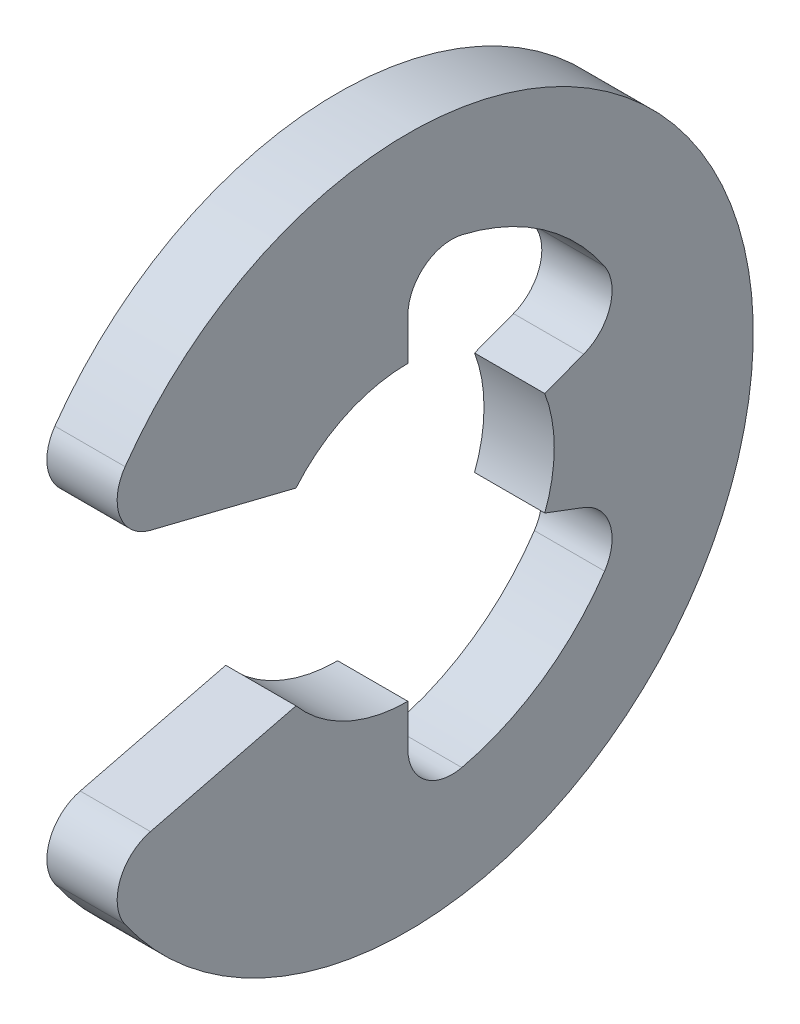
ISO-10303-21;
HEADER;
FILE_DESCRIPTION(('STEP AP214'),'2;1');
FILE_NAME('part.step','',(''),(''),'','','');
FILE_SCHEMA(('AUTOMOTIVE_DESIGN { 1 0 10303 214 1 1 1 1 }'));
ENDSEC;
DATA;
#1=APPLICATION_CONTEXT('core data for automotive mechanical design processes');
#2=APPLICATION_PROTOCOL_DEFINITION('international standard','automotive_design',2000,#1);
#3=PRODUCT_CONTEXT('',#1,'mechanical');
#4=PRODUCT('Part','Part','',(#3));
#5=PRODUCT_RELATED_PRODUCT_CATEGORY('part','',(#4));
#6=PRODUCT_DEFINITION_FORMATION('','',#4);
#7=PRODUCT_DEFINITION_CONTEXT('part definition',#1,'design');
#8=PRODUCT_DEFINITION('design','',#6,#7);
#9=PRODUCT_DEFINITION_SHAPE('','',#8);
#10=(LENGTH_UNIT() NAMED_UNIT(*) SI_UNIT(.MILLI.,.METRE.));
#11=(NAMED_UNIT(*) PLANE_ANGLE_UNIT() SI_UNIT($,.RADIAN.));
#12=(NAMED_UNIT(*) SI_UNIT($,.STERADIAN.) SOLID_ANGLE_UNIT());
#13=UNCERTAINTY_MEASURE_WITH_UNIT(LENGTH_MEASURE(1.E-05),#10,'distance_accuracy_value','');
#14=(GEOMETRIC_REPRESENTATION_CONTEXT(3) GLOBAL_UNCERTAINTY_ASSIGNED_CONTEXT((#13)) GLOBAL_UNIT_ASSIGNED_CONTEXT((#10,
#11,#12)) REPRESENTATION_CONTEXT('',''));
#15=CARTESIAN_POINT('',(0.,0.,0.));
#16=DIRECTION('',(0.,0.,1.));
#17=DIRECTION('',(1.,0.,0.));
#18=AXIS2_PLACEMENT_3D('',#15,#16,#17);
#19=CARTESIAN_POINT('',(0.3,0.,0.));
#20=DIRECTION('',(-1.,0.,0.));
#21=DIRECTION('',(0.,0.,1.));
#22=AXIS2_PLACEMENT_3D('',#19,#20,#21);
#23=CYLINDRICAL_SURFACE('',#22,2.95);
#24=CARTESIAN_POINT('',(0.3,0.,0.));
#25=DIRECTION('',(1.,0.,0.));
#26=DIRECTION('',(0.,0.,-1.));
#27=AXIS2_PLACEMENT_3D('',#24,#25,#26);
#28=CIRCLE('',#27,2.95);
#29=CARTESIAN_POINT('',(0.3,-1.69333134739096,2.4156011566364));
#30=VERTEX_POINT('',#29);
#31=CARTESIAN_POINT('',(0.3,1.69333134739096,2.4156011566364));
#32=VERTEX_POINT('',#31);
#33=EDGE_CURVE('E179',#30,#32,#28,.T.);
#34=ORIENTED_EDGE('',*,*,#33,.F.);
#35=DIRECTION('',(-1.,0.,0.));
#36=VECTOR('',#35,1.);
#37=CARTESIAN_POINT('',(0.3,-1.69333134739096,2.4156011566364));
#38=LINE('',#37,#36);
#39=CARTESIAN_POINT('',(-0.3,-1.69333134739096,2.4156011566364));
#40=VERTEX_POINT('',#39);
#41=EDGE_CURVE('E219',#30,#40,#38,.T.);
#42=ORIENTED_EDGE('',*,*,#41,.T.);
#43=CARTESIAN_POINT('',(-0.3,0.,0.));
#44=DIRECTION('',(1.,0.,0.));
#45=DIRECTION('',(0.,0.,-1.));
#46=AXIS2_PLACEMENT_3D('',#43,#44,#45);
#47=CIRCLE('',#46,2.95);
#48=CARTESIAN_POINT('',(-0.3,1.69333134739096,2.4156011566364));
#49=VERTEX_POINT('',#48);
#50=EDGE_CURVE('E163',#40,#49,#47,.T.);
#51=ORIENTED_EDGE('',*,*,#50,.T.);
#52=DIRECTION('',(-1.,0.,0.));
#53=VECTOR('',#52,1.);
#54=CARTESIAN_POINT('',(0.3,1.69333134739096,2.4156011566364));
#55=LINE('',#54,#53);
#56=EDGE_CURVE('E217',#49,#32,#55,.F.);
#57=ORIENTED_EDGE('',*,*,#56,.T.);
#58=EDGE_LOOP('',(#34,#42,#51,#57));
#59=FACE_BOUND('',#58,.T.);
#60=ADVANCED_FACE('F16',(#59),#23,.T.);
#61=CARTESIAN_POINT('',(0.3,1.2335036372562,2.67973296745697));
#62=DIRECTION('',(0.,0.970536829925373,-0.240952820606874));
#63=DIRECTION('',(0.,0.240952820606874,0.970536829925373));
#64=AXIS2_PLACEMENT_3D('',#61,#62,#63);
#65=PLANE('',#64);
#66=DIRECTION('',(0.,-0.240952820606874,-0.970536829925373));
#67=VECTOR('',#66,1.);
#68=CARTESIAN_POINT('',(-0.3,1.2335036372562,2.67973296745697));
#69=LINE('',#68,#67);
#70=CARTESIAN_POINT('',(-0.3,1.11412605133111,2.19889052072376));
#71=VERTEX_POINT('',#70);
#72=CARTESIAN_POINT('',(-0.3,0.80551824928254,0.955845358869725));
#73=VERTEX_POINT('',#72);
#74=EDGE_CURVE('E158',#71,#73,#69,.T.);
#75=ORIENTED_EDGE('',*,*,#74,.T.);
#76=DIRECTION('',(1.,0.,0.));
#77=VECTOR('',#76,1.);
#78=CARTESIAN_POINT('',(-0.3,0.80551824928254,0.955845358869724));
#79=LINE('',#78,#77);
#80=CARTESIAN_POINT('',(0.3,0.80551824928254,0.955845358869724));
#81=VERTEX_POINT('',#80);
#82=EDGE_CURVE('E31',#73,#81,#79,.T.);
#83=ORIENTED_EDGE('',*,*,#82,.T.);
#84=DIRECTION('',(0.,-0.240952820606874,-0.970536829925373));
#85=VECTOR('',#84,1.);
#86=CARTESIAN_POINT('',(0.3,1.2335036372562,2.67973296745697));
#87=LINE('',#86,#85);
#88=CARTESIAN_POINT('',(0.3,1.11412605133111,2.19889052072376));
#89=VERTEX_POINT('',#88);
#90=EDGE_CURVE('E182',#89,#81,#87,.T.);
#91=ORIENTED_EDGE('',*,*,#90,.F.);
#92=DIRECTION('',(-1.,0.,0.));
#93=VECTOR('',#92,1.);
#94=CARTESIAN_POINT('',(0.3,1.11412605133111,2.19889052072376));
#95=LINE('',#94,#93);
#96=EDGE_CURVE('E234',#89,#71,#95,.T.);
#97=ORIENTED_EDGE('',*,*,#96,.T.);
#98=EDGE_LOOP('',(#75,#83,#91,#97));
#99=FACE_BOUND('',#98,.T.);
#100=ADVANCED_FACE('F311',(#99),#65,.F.);
#101=CARTESIAN_POINT('',(0.3,0.97,0.));
#102=DIRECTION('',(0.,0.,1.));
#103=DIRECTION('',(0.,-1.,0.));
#104=AXIS2_PLACEMENT_3D('',#101,#102,#103);
#105=PLANE('',#104);
#106=DIRECTION('',(0.,1.,0.));
#107=VECTOR('',#106,1.);
#108=CARTESIAN_POINT('',(0.3,0.97,0.));
#109=LINE('',#108,#107);
#110=CARTESIAN_POINT('',(0.3,1.25,0.));
#111=VERTEX_POINT('',#110);
#112=CARTESIAN_POINT('',(0.3,1.60499947322517,0.));
#113=VERTEX_POINT('',#112);
#114=EDGE_CURVE('E151',#111,#113,#109,.T.);
#115=ORIENTED_EDGE('',*,*,#114,.F.);
#116=DIRECTION('',(1.,0.,0.));
#117=VECTOR('',#116,1.);
#118=CARTESIAN_POINT('',(-0.3,1.25,0.));
#119=LINE('',#118,#117);
#120=CARTESIAN_POINT('',(-0.3,1.25,0.));
#121=VERTEX_POINT('',#120);
#122=EDGE_CURVE('E139',#111,#121,#119,.F.);
#123=ORIENTED_EDGE('',*,*,#122,.T.);
#124=DIRECTION('',(0.,1.,0.));
#125=VECTOR('',#124,1.);
#126=CARTESIAN_POINT('',(-0.3,0.97,0.));
#127=LINE('',#126,#125);
#128=CARTESIAN_POINT('',(-0.3,1.60499947322517,0.));
#129=VERTEX_POINT('',#128);
#130=EDGE_CURVE('E149',#121,#129,#127,.T.);
#131=ORIENTED_EDGE('',*,*,#130,.T.);
#132=DIRECTION('',(1.,0.,0.));
#133=VECTOR('',#132,1.);
#134=CARTESIAN_POINT('',(0.3,1.60499947322517,0.));
#135=LINE('',#134,#133);
#136=EDGE_CURVE('E215',#129,#113,#135,.T.);
#137=ORIENTED_EDGE('',*,*,#136,.T.);
#138=EDGE_LOOP('',(#115,#123,#131,#137));
#139=FACE_BOUND('',#138,.T.);
#140=ADVANCED_FACE('F147',(#139),#105,.F.);
#141=CARTESIAN_POINT('',(0.3,0.,0.));
#142=DIRECTION('',(-1.,0.,0.));
#143=DIRECTION('',(0.,0.,1.));
#144=AXIS2_PLACEMENT_3D('',#141,#142,#143);
#145=CYLINDRICAL_SURFACE('',#144,2.02322580645161);
#146=CARTESIAN_POINT('',(0.3,0.,0.));
#147=DIRECTION('',(-1.,0.,0.));
#148=DIRECTION('',(0.,0.,-1.));
#149=AXIS2_PLACEMENT_3D('',#146,#147,#148);
#150=CIRCLE('',#149,2.02322580645161);
#151=CARTESIAN_POINT('',(0.3,1.97016473159179,-0.460319013602111));
#152=VERTEX_POINT('',#151);
#153=CARTESIAN_POINT('',(0.3,1.12714743026078,-1.6801730072669));
#154=VERTEX_POINT('',#153);
#155=EDGE_CURVE('E186',#152,#154,#150,.T.);
#156=ORIENTED_EDGE('',*,*,#155,.F.);
#157=DIRECTION('',(-1.,0.,0.));
#158=VECTOR('',#157,1.);
#159=CARTESIAN_POINT('',(0.3,1.97016473159179,-0.460319013602111));
#160=LINE('',#159,#158);
#161=CARTESIAN_POINT('',(-0.3,1.97016473159179,-0.460319013602111));
#162=VERTEX_POINT('',#161);
#163=EDGE_CURVE('E212',#152,#162,#160,.T.);
#164=ORIENTED_EDGE('',*,*,#163,.T.);
#165=CARTESIAN_POINT('',(-0.3,0.,0.));
#166=DIRECTION('',(-1.,0.,0.));
#167=DIRECTION('',(0.,0.,-1.));
#168=AXIS2_PLACEMENT_3D('',#165,#166,#167);
#169=CIRCLE('',#168,2.02322580645161);
#170=CARTESIAN_POINT('',(-0.3,1.12714743026078,-1.6801730072669));
#171=VERTEX_POINT('',#170);
#172=EDGE_CURVE('E157',#162,#171,#169,.T.);
#173=ORIENTED_EDGE('',*,*,#172,.T.);
#174=DIRECTION('',(-1.,0.,0.));
#175=VECTOR('',#174,1.);
#176=CARTESIAN_POINT('',(0.3,1.12714743026078,-1.6801730072669));
#177=LINE('',#176,#175);
#178=EDGE_CURVE('E210',#171,#154,#177,.F.);
#179=ORIENTED_EDGE('',*,*,#178,.T.);
#180=EDGE_LOOP('',(#156,#164,#173,#179));
#181=FACE_BOUND('',#180,.T.);
#182=ADVANCED_FACE('F318',(#181),#145,.F.);
#183=CARTESIAN_POINT('',(0.3,0.342946788875474,-0.907351916292681));
#184=DIRECTION('',(0.,-0.935414346693485,-0.353553390593276));
#185=DIRECTION('',(0.,0.353553390593276,-0.935414346693485));
#186=AXIS2_PLACEMENT_3D('',#183,#184,#185);
#187=PLANE('',#186);
#188=DIRECTION('',(0.,-0.353553390593276,0.935414346693485));
#189=VECTOR('',#188,1.);
#190=CARTESIAN_POINT('',(-0.3,0.342946788875474,-0.907351916292681));
#191=LINE('',#190,#189);
#192=CARTESIAN_POINT('',(-0.3,0.567453005659178,-1.50133953369031));
#193=VERTEX_POINT('',#192);
#194=CARTESIAN_POINT('',(-0.3,0.441941738241592,-1.16926793336686));
#195=VERTEX_POINT('',#194);
#196=EDGE_CURVE('E161',#193,#195,#191,.T.);
#197=ORIENTED_EDGE('',*,*,#196,.T.);
#198=DIRECTION('',(1.,0.,0.));
#199=VECTOR('',#198,1.);
#200=CARTESIAN_POINT('',(-0.3,0.441941738241592,-1.16926793336686));
#201=LINE('',#200,#199);
#202=CARTESIAN_POINT('',(0.3,0.441941738241591,-1.16926793336686));
#203=VERTEX_POINT('',#202);
#204=EDGE_CURVE('E38',#195,#203,#201,.T.);
#205=ORIENTED_EDGE('',*,*,#204,.T.);
#206=DIRECTION('',(0.,-0.353553390593276,0.935414346693485));
#207=VECTOR('',#206,1.);
#208=CARTESIAN_POINT('',(0.3,0.342946788875474,-0.907351916292681));
#209=LINE('',#208,#207);
#210=CARTESIAN_POINT('',(0.3,0.567453005659178,-1.50133953369031));
#211=VERTEX_POINT('',#210);
#212=EDGE_CURVE('E189',#211,#203,#209,.T.);
#213=ORIENTED_EDGE('',*,*,#212,.F.);
#214=DIRECTION('',(1.,0.,0.));
#215=VECTOR('',#214,1.);
#216=CARTESIAN_POINT('',(-0.3,0.567453005659177,-1.50133953369031));
#217=LINE('',#216,#215);
#218=EDGE_CURVE('E240',#211,#193,#217,.F.);
#219=ORIENTED_EDGE('',*,*,#218,.T.);
#220=EDGE_LOOP('',(#197,#205,#213,#219));
#221=FACE_BOUND('',#220,.T.);
#222=ADVANCED_FACE('F323',(#221),#187,.F.);
#223=CARTESIAN_POINT('',(0.3,-0.342946788875474,-0.907351916292681));
#224=DIRECTION('',(0.,0.935414346693485,-0.353553390593275));
#225=DIRECTION('',(0.,0.353553390593275,0.935414346693485));
#226=AXIS2_PLACEMENT_3D('',#223,#224,#225);
#227=PLANE('',#226);
#228=DIRECTION('',(0.,-0.353553390593275,-0.935414346693485));
#229=VECTOR('',#228,1.);
#230=CARTESIAN_POINT('',(0.3,-0.342946788875474,-0.907351916292681));
#231=LINE('',#230,#229);
#232=CARTESIAN_POINT('',(0.3,-0.441941738241591,-1.16926793336686));
#233=VERTEX_POINT('',#232);
#234=CARTESIAN_POINT('',(0.3,-0.567453005659177,-1.50133953369031));
#235=VERTEX_POINT('',#234);
#236=EDGE_CURVE('E192',#233,#235,#231,.T.);
#237=ORIENTED_EDGE('',*,*,#236,.F.);
#238=DIRECTION('',(1.,0.,0.));
#239=VECTOR('',#238,1.);
#240=CARTESIAN_POINT('',(-0.3,-0.441941738241591,-1.16926793336686));
#241=LINE('',#240,#239);
#242=CARTESIAN_POINT('',(-0.3,-0.441941738241591,-1.16926793336686));
#243=VERTEX_POINT('',#242);
#244=EDGE_CURVE('E290',#233,#243,#241,.F.);
#245=ORIENTED_EDGE('',*,*,#244,.T.);
#246=DIRECTION('',(0.,-0.353553390593275,-0.935414346693485));
#247=VECTOR('',#246,1.);
#248=CARTESIAN_POINT('',(-0.3,-0.342946788875474,-0.907351916292681));
#249=LINE('',#248,#247);
#250=CARTESIAN_POINT('',(-0.3,-0.567453005659177,-1.50133953369031));
#251=VERTEX_POINT('',#250);
#252=EDGE_CURVE('E169',#243,#251,#249,.T.);
#253=ORIENTED_EDGE('',*,*,#252,.T.);
#254=DIRECTION('',(1.,0.,0.));
#255=VECTOR('',#254,1.);
#256=CARTESIAN_POINT('',(0.3,-0.567453005659177,-1.50133953369031));
#257=LINE('',#256,#255);
#258=EDGE_CURVE('E237',#251,#235,#257,.T.);
#259=ORIENTED_EDGE('',*,*,#258,.T.);
#260=EDGE_LOOP('',(#237,#245,#253,#259));
#261=FACE_BOUND('',#260,.T.);
#262=ADVANCED_FACE('F289',(#261),#227,.F.);
#263=CARTESIAN_POINT('',(0.3,0.,0.));
#264=DIRECTION('',(-1.,0.,0.));
#265=DIRECTION('',(0.,0.,1.));
#266=AXIS2_PLACEMENT_3D('',#263,#264,#265);
#267=CYLINDRICAL_SURFACE('',#266,2.02322580645161);
#268=CARTESIAN_POINT('',(-0.3,0.,0.));
#269=DIRECTION('',(-1.,0.,0.));
#270=DIRECTION('',(0.,0.,-1.));
#271=AXIS2_PLACEMENT_3D('',#268,#269,#270);
#272=CIRCLE('',#271,2.02322580645161);
#273=CARTESIAN_POINT('',(-0.3,-1.12714743026078,-1.6801730072669));
#274=VERTEX_POINT('',#273);
#275=CARTESIAN_POINT('',(-0.3,-1.97016473159179,-0.460319013602112));
#276=VERTEX_POINT('',#275);
#277=EDGE_CURVE('E171',#274,#276,#272,.T.);
#278=ORIENTED_EDGE('',*,*,#277,.T.);
#279=DIRECTION('',(-1.,0.,0.));
#280=VECTOR('',#279,1.);
#281=CARTESIAN_POINT('',(0.3,-1.97016473159179,-0.460319013602112));
#282=LINE('',#281,#280);
#283=CARTESIAN_POINT('',(0.3,-1.97016473159179,-0.460319013602112));
#284=VERTEX_POINT('',#283);
#285=EDGE_CURVE('E208',#276,#284,#282,.F.);
#286=ORIENTED_EDGE('',*,*,#285,.T.);
#287=CARTESIAN_POINT('',(0.3,0.,0.));
#288=DIRECTION('',(-1.,0.,0.));
#289=DIRECTION('',(0.,0.,-1.));
#290=AXIS2_PLACEMENT_3D('',#287,#288,#289);
#291=CIRCLE('',#290,2.02322580645161);
#292=CARTESIAN_POINT('',(0.3,-1.12714743026078,-1.6801730072669));
#293=VERTEX_POINT('',#292);
#294=EDGE_CURVE('E194',#293,#284,#291,.T.);
#295=ORIENTED_EDGE('',*,*,#294,.F.);
#296=DIRECTION('',(-1.,0.,0.));
#297=VECTOR('',#296,1.);
#298=CARTESIAN_POINT('',(0.3,-1.12714743026078,-1.6801730072669));
#299=LINE('',#298,#297);
#300=EDGE_CURVE('E205',#293,#274,#299,.T.);
#301=ORIENTED_EDGE('',*,*,#300,.T.);
#302=EDGE_LOOP('',(#278,#286,#295,#301));
#303=FACE_BOUND('',#302,.T.);
#304=ADVANCED_FACE('F279',(#303),#267,.F.);
#305=CARTESIAN_POINT('',(0.3,-0.97,0.));
#306=DIRECTION('',(0.,0.,1.));
#307=DIRECTION('',(0.,-1.,0.));
#308=AXIS2_PLACEMENT_3D('',#305,#306,#307);
#309=PLANE('',#308);
#310=DIRECTION('',(0.,1.,0.));
#311=VECTOR('',#310,1.);
#312=CARTESIAN_POINT('',(-0.3,-0.97,0.));
#313=LINE('',#312,#311);
#314=CARTESIAN_POINT('',(-0.3,-1.60499947322517,0.));
#315=VERTEX_POINT('',#314);
#316=CARTESIAN_POINT('',(-0.3,-1.25,0.));
#317=VERTEX_POINT('',#316);
#318=EDGE_CURVE('E174',#315,#317,#313,.T.);
#319=ORIENTED_EDGE('',*,*,#318,.T.);
#320=DIRECTION('',(1.,0.,0.));
#321=VECTOR('',#320,1.);
#322=CARTESIAN_POINT('',(-0.3,-1.25,0.));
#323=LINE('',#322,#321);
#324=CARTESIAN_POINT('',(0.3,-1.25,0.));
#325=VERTEX_POINT('',#324);
#326=EDGE_CURVE('E271',#317,#325,#323,.T.);
#327=ORIENTED_EDGE('',*,*,#326,.T.);
#328=DIRECTION('',(0.,1.,0.));
#329=VECTOR('',#328,1.);
#330=CARTESIAN_POINT('',(0.3,-0.97,0.));
#331=LINE('',#330,#329);
#332=CARTESIAN_POINT('',(0.3,-1.60499947322517,0.));
#333=VERTEX_POINT('',#332);
#334=EDGE_CURVE('E197',#333,#325,#331,.T.);
#335=ORIENTED_EDGE('',*,*,#334,.F.);
#336=DIRECTION('',(1.,0.,0.));
#337=VECTOR('',#336,1.);
#338=CARTESIAN_POINT('',(-0.3,-1.60499947322517,0.));
#339=LINE('',#338,#337);
#340=EDGE_CURVE('E202',#333,#315,#339,.F.);
#341=ORIENTED_EDGE('',*,*,#340,.T.);
#342=EDGE_LOOP('',(#319,#327,#335,#341));
#343=FACE_BOUND('',#342,.T.);
#344=ADVANCED_FACE('F269',(#343),#309,.F.);
#345=CARTESIAN_POINT('',(0.3,-1.2335036372562,2.67973296745697));
#346=DIRECTION('',(0.,-0.970536829925373,-0.240952820606874));
#347=DIRECTION('',(0.,0.240952820606874,-0.970536829925373));
#348=AXIS2_PLACEMENT_3D('',#345,#346,#347);
#349=PLANE('',#348);
#350=DIRECTION('',(0.,-0.240952820606874,0.970536829925373));
#351=VECTOR('',#350,1.);
#352=CARTESIAN_POINT('',(0.3,-1.2335036372562,2.67973296745697));
#353=LINE('',#352,#351);
#354=CARTESIAN_POINT('',(0.3,-0.80551824928254,0.955845358869724));
#355=VERTEX_POINT('',#354);
#356=CARTESIAN_POINT('',(0.3,-1.11412605133111,2.19889052072376));
#357=VERTEX_POINT('',#356);
#358=EDGE_CURVE('E200',#355,#357,#353,.T.);
#359=ORIENTED_EDGE('',*,*,#358,.F.);
#360=DIRECTION('',(1.,0.,0.));
#361=VECTOR('',#360,1.);
#362=CARTESIAN_POINT('',(-0.3,-0.80551824928254,0.955845358869724));
#363=LINE('',#362,#361);
#364=CARTESIAN_POINT('',(-0.3,-0.80551824928254,0.955845358869724));
#365=VERTEX_POINT('',#364);
#366=EDGE_CURVE('E294',#355,#365,#363,.F.);
#367=ORIENTED_EDGE('',*,*,#366,.T.);
#368=DIRECTION('',(0.,-0.240952820606874,0.970536829925373));
#369=VECTOR('',#368,1.);
#370=CARTESIAN_POINT('',(-0.3,-1.2335036372562,2.67973296745697));
#371=LINE('',#370,#369);
#372=CARTESIAN_POINT('',(-0.3,-1.11412605133111,2.19889052072376));
#373=VERTEX_POINT('',#372);
#374=EDGE_CURVE('E177',#365,#373,#371,.T.);
#375=ORIENTED_EDGE('',*,*,#374,.T.);
#376=DIRECTION('',(-1.,0.,0.));
#377=VECTOR('',#376,1.);
#378=CARTESIAN_POINT('',(0.3,-1.11412605133111,2.19889052072376));
#379=LINE('',#378,#377);
#380=EDGE_CURVE('E227',#373,#357,#379,.F.);
#381=ORIENTED_EDGE('',*,*,#380,.T.);
#382=EDGE_LOOP('',(#359,#367,#375,#381));
#383=FACE_BOUND('',#382,.T.);
#384=ADVANCED_FACE('F334',(#383),#349,.F.);
#385=CARTESIAN_POINT('',(0.3,0.,0.));
#386=DIRECTION('',(1.,0.,0.));
#387=DIRECTION('',(0.,0.,-1.));
#388=AXIS2_PLACEMENT_3D('',#385,#386,#387);
#389=PLANE('',#388);
#390=CARTESIAN_POINT('',(0.3,0.,0.));
#391=DIRECTION('',(1.,0.,0.));
#392=DIRECTION('',(0.,0.,-1.));
#393=AXIS2_PLACEMENT_3D('',#390,#391,#392);
#394=CIRCLE('',#393,1.25);
#395=EDGE_CURVE('E495',#111,#81,#394,.T.);
#396=ORIENTED_EDGE('',*,*,#395,.F.);
#397=ORIENTED_EDGE('',*,*,#114,.T.);
#398=CARTESIAN_POINT('',(0.3,1.60499947322517,-0.375));
#399=DIRECTION('',(1.,0.,0.));
#400=DIRECTION('',(0.,0.,-1.));
#401=AXIS2_PLACEMENT_3D('',#398,#399,#400);
#402=CIRCLE('',#401,0.375);
#403=EDGE_CURVE('E248',#113,#152,#402,.F.);
#404=ORIENTED_EDGE('',*,*,#403,.T.);
#405=ORIENTED_EDGE('',*,*,#155,.T.);
#406=CARTESIAN_POINT('',(0.3,0.918233385669234,-1.36875701221783));
#407=DIRECTION('',(1.,0.,0.));
#408=DIRECTION('',(0.,0.,-1.));
#409=AXIS2_PLACEMENT_3D('',#406,#407,#408);
#410=CIRCLE('',#409,0.375);
#411=EDGE_CURVE('E256',#154,#211,#410,.F.);
#412=ORIENTED_EDGE('',*,*,#411,.T.);
#413=ORIENTED_EDGE('',*,*,#212,.T.);
#414=EDGE_CURVE('E498',#233,#203,#394,.T.);
#415=ORIENTED_EDGE('',*,*,#414,.F.);
#416=ORIENTED_EDGE('',*,*,#236,.T.);
#417=CARTESIAN_POINT('',(0.3,-0.918233385669234,-1.36875701221783));
#418=DIRECTION('',(1.,0.,0.));
#419=DIRECTION('',(0.,0.,-1.));
#420=AXIS2_PLACEMENT_3D('',#417,#418,#419);
#421=CIRCLE('',#420,0.375);
#422=EDGE_CURVE('E253',#235,#293,#421,.F.);
#423=ORIENTED_EDGE('',*,*,#422,.T.);
#424=ORIENTED_EDGE('',*,*,#294,.T.);
#425=CARTESIAN_POINT('',(0.3,-1.60499947322517,-0.375));
#426=DIRECTION('',(1.,0.,0.));
#427=DIRECTION('',(0.,0.,-1.));
#428=AXIS2_PLACEMENT_3D('',#425,#426,#427);
#429=CIRCLE('',#428,0.375);
#430=EDGE_CURVE('E245',#284,#333,#429,.F.);
#431=ORIENTED_EDGE('',*,*,#430,.T.);
#432=ORIENTED_EDGE('',*,*,#334,.T.);
#433=EDGE_CURVE('E496',#355,#325,#394,.T.);
#434=ORIENTED_EDGE('',*,*,#433,.F.);
#435=ORIENTED_EDGE('',*,*,#358,.T.);
#436=CARTESIAN_POINT('',(0.3,-1.47807736255313,2.10853321299618));
#437=DIRECTION('',(1.,0.,0.));
#438=DIRECTION('',(0.,0.,-1.));
#439=AXIS2_PLACEMENT_3D('',#436,#437,#438);
#440=CIRCLE('',#439,0.375);
#441=EDGE_CURVE('E232',#357,#30,#440,.T.);
#442=ORIENTED_EDGE('',*,*,#441,.T.);
#443=ORIENTED_EDGE('',*,*,#33,.T.);
#444=CARTESIAN_POINT('',(0.3,1.47807736255313,2.10853321299618));
#445=DIRECTION('',(1.,0.,0.));
#446=DIRECTION('',(0.,0.,-1.));
#447=AXIS2_PLACEMENT_3D('',#444,#445,#446);
#448=CIRCLE('',#447,0.375);
#449=EDGE_CURVE('E230',#32,#89,#448,.T.);
#450=ORIENTED_EDGE('',*,*,#449,.T.);
#451=ORIENTED_EDGE('',*,*,#90,.T.);
#452=EDGE_LOOP('',(#396,#397,#404,#405,#412,#413,#415,#416,#423,#424,#431,#432,#434,#435,#442,
#443,#450,#451));
#453=FACE_BOUND('',#452,.T.);
#454=ADVANCED_FACE('F309',(#453),#389,.T.);
#455=CARTESIAN_POINT('',(-0.3,0.,0.));
#456=DIRECTION('',(1.,0.,0.));
#457=DIRECTION('',(0.,0.,-1.));
#458=AXIS2_PLACEMENT_3D('',#455,#456,#457);
#459=PLANE('',#458);
#460=ORIENTED_EDGE('',*,*,#130,.F.);
#461=CARTESIAN_POINT('',(-0.3,0.,0.));
#462=DIRECTION('',(1.,0.,0.));
#463=DIRECTION('',(0.,0.,-1.));
#464=AXIS2_PLACEMENT_3D('',#461,#462,#463);
#465=CIRCLE('',#464,1.25);
#466=EDGE_CURVE('E11',#121,#73,#465,.T.);
#467=ORIENTED_EDGE('',*,*,#466,.T.);
#468=ORIENTED_EDGE('',*,*,#74,.F.);
#469=CARTESIAN_POINT('',(-0.3,1.47807736255313,2.10853321299618));
#470=DIRECTION('',(1.,0.,0.));
#471=DIRECTION('',(0.,0.,-1.));
#472=AXIS2_PLACEMENT_3D('',#469,#470,#471);
#473=CIRCLE('',#472,0.375);
#474=EDGE_CURVE('E222',#71,#49,#473,.F.);
#475=ORIENTED_EDGE('',*,*,#474,.T.);
#476=ORIENTED_EDGE('',*,*,#50,.F.);
#477=CARTESIAN_POINT('',(-0.3,-1.47807736255313,2.10853321299618));
#478=DIRECTION('',(1.,0.,0.));
#479=DIRECTION('',(0.,0.,-1.));
#480=AXIS2_PLACEMENT_3D('',#477,#478,#479);
#481=CIRCLE('',#480,0.375);
#482=EDGE_CURVE('E224',#40,#373,#481,.F.);
#483=ORIENTED_EDGE('',*,*,#482,.T.);
#484=ORIENTED_EDGE('',*,*,#374,.F.);
#485=EDGE_CURVE('E24',#365,#317,#465,.T.);
#486=ORIENTED_EDGE('',*,*,#485,.T.);
#487=ORIENTED_EDGE('',*,*,#318,.F.);
#488=CARTESIAN_POINT('',(-0.3,-1.60499947322517,-0.375));
#489=DIRECTION('',(1.,0.,0.));
#490=DIRECTION('',(0.,0.,-1.));
#491=AXIS2_PLACEMENT_3D('',#488,#489,#490);
#492=CIRCLE('',#491,0.375);
#493=EDGE_CURVE('E243',#315,#276,#492,.T.);
#494=ORIENTED_EDGE('',*,*,#493,.T.);
#495=ORIENTED_EDGE('',*,*,#277,.F.);
#496=CARTESIAN_POINT('',(-0.3,-0.918233385669234,-1.36875701221783));
#497=DIRECTION('',(1.,0.,0.));
#498=DIRECTION('',(0.,0.,-1.));
#499=AXIS2_PLACEMENT_3D('',#496,#497,#498);
#500=CIRCLE('',#499,0.375);
#501=EDGE_CURVE('E250',#274,#251,#500,.T.);
#502=ORIENTED_EDGE('',*,*,#501,.T.);
#503=ORIENTED_EDGE('',*,*,#252,.F.);
#504=EDGE_CURVE('E19',#243,#195,#465,.T.);
#505=ORIENTED_EDGE('',*,*,#504,.T.);
#506=ORIENTED_EDGE('',*,*,#196,.F.);
#507=CARTESIAN_POINT('',(-0.3,0.918233385669234,-1.36875701221783));
#508=DIRECTION('',(1.,0.,0.));
#509=DIRECTION('',(0.,0.,-1.));
#510=AXIS2_PLACEMENT_3D('',#507,#508,#509);
#511=CIRCLE('',#510,0.375);
#512=EDGE_CURVE('E255',#193,#171,#511,.T.);
#513=ORIENTED_EDGE('',*,*,#512,.T.);
#514=ORIENTED_EDGE('',*,*,#172,.F.);
#515=CARTESIAN_POINT('',(-0.3,1.60499947322517,-0.375));
#516=DIRECTION('',(1.,0.,0.));
#517=DIRECTION('',(0.,0.,-1.));
#518=AXIS2_PLACEMENT_3D('',#515,#516,#517);
#519=CIRCLE('',#518,0.375);
#520=EDGE_CURVE('E155',#162,#129,#519,.T.);
#521=ORIENTED_EDGE('',*,*,#520,.T.);
#522=EDGE_LOOP('',(#460,#467,#468,#475,#476,#483,#484,#486,#487,#494,#495,#502,#503,#505,#506,
#513,#514,#521));
#523=FACE_BOUND('',#522,.T.);
#524=ADVANCED_FACE('F153',(#523),#459,.F.);
#525=CARTESIAN_POINT('',(0.3,-1.60499947322517,-0.375));
#526=DIRECTION('',(-1.,0.,0.));
#527=DIRECTION('',(0.,0.,1.));
#528=AXIS2_PLACEMENT_3D('',#525,#526,#527);
#529=CYLINDRICAL_SURFACE('',#528,0.375);
#530=ORIENTED_EDGE('',*,*,#430,.F.);
#531=ORIENTED_EDGE('',*,*,#285,.F.);
#532=ORIENTED_EDGE('',*,*,#493,.F.);
#533=ORIENTED_EDGE('',*,*,#340,.F.);
#534=EDGE_LOOP('',(#530,#531,#532,#533));
#535=FACE_BOUND('',#534,.T.);
#536=ADVANCED_FACE('F275',(#535),#529,.F.);
#537=CARTESIAN_POINT('',(0.3,1.60499947322517,-0.375));
#538=DIRECTION('',(-1.,0.,0.));
#539=DIRECTION('',(0.,0.,1.));
#540=AXIS2_PLACEMENT_3D('',#537,#538,#539);
#541=CYLINDRICAL_SURFACE('',#540,0.375);
#542=ORIENTED_EDGE('',*,*,#403,.F.);
#543=ORIENTED_EDGE('',*,*,#136,.F.);
#544=ORIENTED_EDGE('',*,*,#520,.F.);
#545=ORIENTED_EDGE('',*,*,#163,.F.);
#546=EDGE_LOOP('',(#542,#543,#544,#545));
#547=FACE_BOUND('',#546,.T.);
#548=ADVANCED_FACE('F344',(#547),#541,.F.);
#549=CARTESIAN_POINT('',(0.3,-1.47807736255313,2.10853321299618));
#550=DIRECTION('',(-1.,0.,0.));
#551=DIRECTION('',(0.,0.,1.));
#552=AXIS2_PLACEMENT_3D('',#549,#550,#551);
#553=CYLINDRICAL_SURFACE('',#552,0.375);
#554=ORIENTED_EDGE('',*,*,#441,.F.);
#555=ORIENTED_EDGE('',*,*,#380,.F.);
#556=ORIENTED_EDGE('',*,*,#482,.F.);
#557=ORIENTED_EDGE('',*,*,#41,.F.);
#558=EDGE_LOOP('',(#554,#555,#556,#557));
#559=FACE_BOUND('',#558,.T.);
#560=ADVANCED_FACE('F347',(#559),#553,.T.);
#561=CARTESIAN_POINT('',(0.3,1.47807736255313,2.10853321299618));
#562=DIRECTION('',(-1.,0.,0.));
#563=DIRECTION('',(0.,0.,1.));
#564=AXIS2_PLACEMENT_3D('',#561,#562,#563);
#565=CYLINDRICAL_SURFACE('',#564,0.375);
#566=ORIENTED_EDGE('',*,*,#449,.F.);
#567=ORIENTED_EDGE('',*,*,#56,.F.);
#568=ORIENTED_EDGE('',*,*,#474,.F.);
#569=ORIENTED_EDGE('',*,*,#96,.F.);
#570=EDGE_LOOP('',(#566,#567,#568,#569));
#571=FACE_BOUND('',#570,.T.);
#572=ADVANCED_FACE('F306',(#571),#565,.T.);
#573=CARTESIAN_POINT('',(0.3,-0.918233385669234,-1.36875701221783));
#574=DIRECTION('',(-1.,0.,0.));
#575=DIRECTION('',(0.,0.,1.));
#576=AXIS2_PLACEMENT_3D('',#573,#574,#575);
#577=CYLINDRICAL_SURFACE('',#576,0.375);
#578=ORIENTED_EDGE('',*,*,#422,.F.);
#579=ORIENTED_EDGE('',*,*,#258,.F.);
#580=ORIENTED_EDGE('',*,*,#501,.F.);
#581=ORIENTED_EDGE('',*,*,#300,.F.);
#582=EDGE_LOOP('',(#578,#579,#580,#581));
#583=FACE_BOUND('',#582,.T.);
#584=ADVANCED_FACE('F284',(#583),#577,.F.);
#585=CARTESIAN_POINT('',(0.3,0.918233385669234,-1.36875701221783));
#586=DIRECTION('',(-1.,0.,0.));
#587=DIRECTION('',(0.,0.,1.));
#588=AXIS2_PLACEMENT_3D('',#585,#586,#587);
#589=CYLINDRICAL_SURFACE('',#588,0.375);
#590=ORIENTED_EDGE('',*,*,#411,.F.);
#591=ORIENTED_EDGE('',*,*,#178,.F.);
#592=ORIENTED_EDGE('',*,*,#512,.F.);
#593=ORIENTED_EDGE('',*,*,#218,.F.);
#594=EDGE_LOOP('',(#590,#591,#592,#593));
#595=FACE_BOUND('',#594,.T.);
#596=ADVANCED_FACE('F356',(#595),#589,.F.);
#597=CARTESIAN_POINT('',(-0.3,0.,0.));
#598=DIRECTION('',(1.,0.,0.));
#599=DIRECTION('',(0.,0.,-1.));
#600=AXIS2_PLACEMENT_3D('',#597,#598,#599);
#601=CYLINDRICAL_SURFACE('',#600,1.25);
#602=ORIENTED_EDGE('',*,*,#504,.F.);
#603=ORIENTED_EDGE('',*,*,#244,.F.);
#604=ORIENTED_EDGE('',*,*,#414,.T.);
#605=ORIENTED_EDGE('',*,*,#204,.F.);
#606=EDGE_LOOP('',(#602,#603,#604,#605));
#607=FACE_BOUND('',#606,.T.);
#608=ADVANCED_FACE('F359',(#607),#601,.F.);
#609=ORIENTED_EDGE('',*,*,#485,.F.);
#610=ORIENTED_EDGE('',*,*,#366,.F.);
#611=ORIENTED_EDGE('',*,*,#433,.T.);
#612=ORIENTED_EDGE('',*,*,#326,.F.);
#613=EDGE_LOOP('',(#609,#610,#611,#612));
#614=FACE_BOUND('',#613,.T.);
#615=ADVANCED_FACE('F362',(#614),#601,.F.);
#616=ORIENTED_EDGE('',*,*,#466,.F.);
#617=ORIENTED_EDGE('',*,*,#122,.F.);
#618=ORIENTED_EDGE('',*,*,#395,.T.);
#619=ORIENTED_EDGE('',*,*,#82,.F.);
#620=EDGE_LOOP('',(#616,#617,#618,#619));
#621=FACE_BOUND('',#620,.T.);
#622=ADVANCED_FACE('F138',(#621),#601,.F.);
#623=CLOSED_SHELL('',(#60,#100,#140,#182,#222,#262,#304,#344,#384,#454,#524,#536,#548,#560,#572,
#584,#596,#608,#615,#622));
#624=MANIFOLD_SOLID_BREP('B1',#623);
#625=ADVANCED_BREP_SHAPE_REPRESENTATION('',(#18,#624),#14);
#626=SHAPE_DEFINITION_REPRESENTATION(#9,#625);
ENDSEC;
END-ISO-10303-21;
